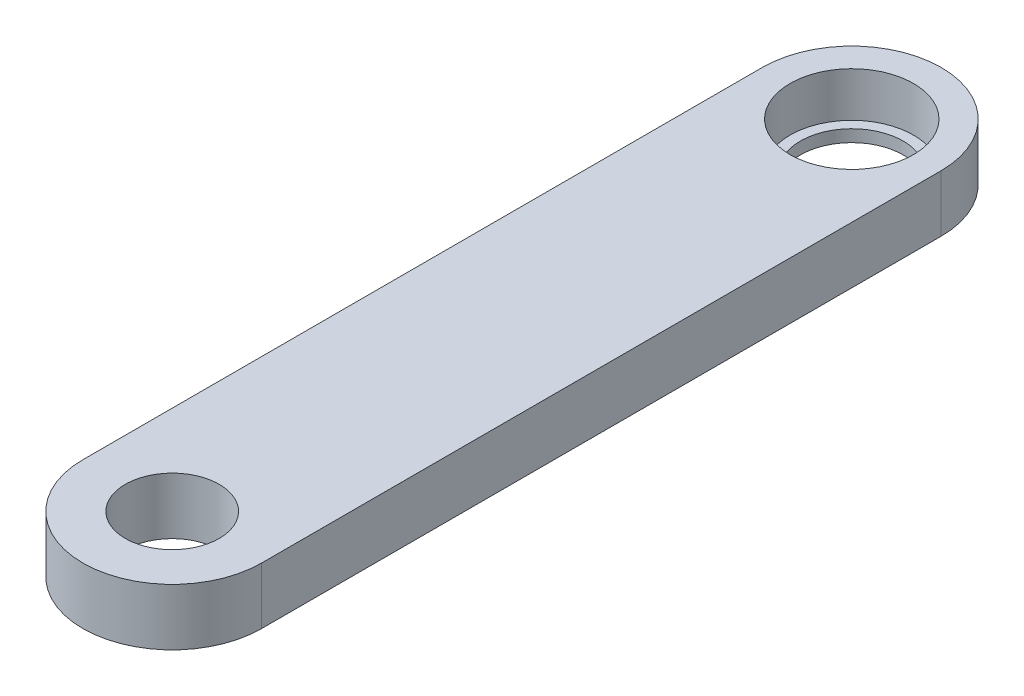
ISO-10303-21;
HEADER;
FILE_DESCRIPTION(('STEP AP214'),'2;1');
FILE_NAME('part.step','',(''),(''),'','','');
FILE_SCHEMA(('AUTOMOTIVE_DESIGN { 1 0 10303 214 1 1 1 1 }'));
ENDSEC;
DATA;
#1=APPLICATION_CONTEXT('core data for automotive mechanical design processes');
#2=APPLICATION_PROTOCOL_DEFINITION('international standard','automotive_design',2000,#1);
#3=PRODUCT_CONTEXT('',#1,'mechanical');
#4=PRODUCT('Part','Part','',(#3));
#5=PRODUCT_RELATED_PRODUCT_CATEGORY('part','',(#4));
#6=PRODUCT_DEFINITION_FORMATION('','',#4);
#7=PRODUCT_DEFINITION_CONTEXT('part definition',#1,'design');
#8=PRODUCT_DEFINITION('design','',#6,#7);
#9=PRODUCT_DEFINITION_SHAPE('','',#8);
#10=(LENGTH_UNIT() NAMED_UNIT(*) SI_UNIT(.MILLI.,.METRE.));
#11=(NAMED_UNIT(*) PLANE_ANGLE_UNIT() SI_UNIT($,.RADIAN.));
#12=(NAMED_UNIT(*) SI_UNIT($,.STERADIAN.) SOLID_ANGLE_UNIT());
#13=UNCERTAINTY_MEASURE_WITH_UNIT(LENGTH_MEASURE(1.E-05),#10,'distance_accuracy_value','');
#14=(GEOMETRIC_REPRESENTATION_CONTEXT(3) GLOBAL_UNCERTAINTY_ASSIGNED_CONTEXT((#13)) GLOBAL_UNIT_ASSIGNED_CONTEXT((#10,
#11,#12)) REPRESENTATION_CONTEXT('',''));
#15=CARTESIAN_POINT('',(0.,0.,0.));
#16=DIRECTION('',(0.,0.,1.));
#17=DIRECTION('',(1.,0.,0.));
#18=AXIS2_PLACEMENT_3D('',#15,#16,#17);
#19=CARTESIAN_POINT('',(0.,1.5875,-19.));
#20=DIRECTION('',(0.,-1.,0.));
#21=DIRECTION('',(0.,0.,-1.));
#22=AXIS2_PLACEMENT_3D('',#19,#20,#21);
#23=CYLINDRICAL_SURFACE('',#22,5.);
#24=CARTESIAN_POINT('',(0.,-1.5875,-19.));
#25=DIRECTION('',(0.,1.,0.));
#26=DIRECTION('',(0.,0.,1.));
#27=AXIS2_PLACEMENT_3D('',#24,#25,#26);
#28=CIRCLE('',#27,5.);
#29=CARTESIAN_POINT('',(-5.,-1.5875,-19.));
#30=VERTEX_POINT('',#29);
#31=CARTESIAN_POINT('',(5.,-1.5875,-19.));
#32=VERTEX_POINT('',#31);
#33=EDGE_CURVE('E117',#30,#32,#28,.F.);
#34=ORIENTED_EDGE('',*,*,#33,.F.);
#35=DIRECTION('',(0.,-1.,0.));
#36=VECTOR('',#35,1.);
#37=CARTESIAN_POINT('',(-5.,1.5875,-19.));
#38=LINE('',#37,#36);
#39=CARTESIAN_POINT('',(-5.,1.5875,-19.));
#40=VERTEX_POINT('',#39);
#41=EDGE_CURVE('E11',#40,#30,#38,.T.);
#42=ORIENTED_EDGE('',*,*,#41,.F.);
#43=CARTESIAN_POINT('',(0.,1.5875,-19.));
#44=DIRECTION('',(0.,1.,0.));
#45=DIRECTION('',(0.,0.,1.));
#46=AXIS2_PLACEMENT_3D('',#43,#44,#45);
#47=CIRCLE('',#46,5.);
#48=CARTESIAN_POINT('',(5.,1.5875,-19.));
#49=VERTEX_POINT('',#48);
#50=EDGE_CURVE('E107',#40,#49,#47,.F.);
#51=ORIENTED_EDGE('',*,*,#50,.T.);
#52=DIRECTION('',(0.,-1.,0.));
#53=VECTOR('',#52,1.);
#54=CARTESIAN_POINT('',(5.,1.5875,-19.));
#55=LINE('',#54,#53);
#56=EDGE_CURVE('E86',#49,#32,#55,.T.);
#57=ORIENTED_EDGE('',*,*,#56,.T.);
#58=EDGE_LOOP('',(#34,#42,#51,#57));
#59=FACE_BOUND('',#58,.T.);
#60=ADVANCED_FACE('F47',(#59),#23,.T.);
#61=CARTESIAN_POINT('',(-5.,1.5875,0.));
#62=DIRECTION('',(-1.,0.,0.));
#63=DIRECTION('',(0.,0.,1.));
#64=AXIS2_PLACEMENT_3D('',#61,#62,#63);
#65=PLANE('',#64);
#66=DIRECTION('',(0.,0.,-1.));
#67=VECTOR('',#66,1.);
#68=CARTESIAN_POINT('',(-5.,-1.5875,0.));
#69=LINE('',#68,#67);
#70=CARTESIAN_POINT('',(-5.,-1.5875,19.));
#71=VERTEX_POINT('',#70);
#72=EDGE_CURVE('E99',#71,#30,#69,.T.);
#73=ORIENTED_EDGE('',*,*,#72,.F.);
#74=DIRECTION('',(0.,-1.,0.));
#75=VECTOR('',#74,1.);
#76=CARTESIAN_POINT('',(-5.,1.5875,19.));
#77=LINE('',#76,#75);
#78=CARTESIAN_POINT('',(-5.,1.5875,19.));
#79=VERTEX_POINT('',#78);
#80=EDGE_CURVE('E56',#79,#71,#77,.T.);
#81=ORIENTED_EDGE('',*,*,#80,.F.);
#82=DIRECTION('',(0.,0.,-1.));
#83=VECTOR('',#82,1.);
#84=CARTESIAN_POINT('',(-5.,1.5875,0.));
#85=LINE('',#84,#83);
#86=EDGE_CURVE('E97',#79,#40,#85,.T.);
#87=ORIENTED_EDGE('',*,*,#86,.T.);
#88=ORIENTED_EDGE('',*,*,#41,.T.);
#89=EDGE_LOOP('',(#73,#81,#87,#88));
#90=FACE_BOUND('',#89,.T.);
#91=ADVANCED_FACE('F95',(#90),#65,.T.);
#92=CARTESIAN_POINT('',(0.,1.5875,19.));
#93=DIRECTION('',(0.,-1.,0.));
#94=DIRECTION('',(0.,0.,-1.));
#95=AXIS2_PLACEMENT_3D('',#92,#93,#94);
#96=CYLINDRICAL_SURFACE('',#95,5.);
#97=CARTESIAN_POINT('',(0.,-1.5875,19.));
#98=DIRECTION('',(0.,1.,0.));
#99=DIRECTION('',(0.,0.,1.));
#100=AXIS2_PLACEMENT_3D('',#97,#98,#99);
#101=CIRCLE('',#100,5.);
#102=CARTESIAN_POINT('',(5.00000000000001,-1.5875,19.));
#103=VERTEX_POINT('',#102);
#104=EDGE_CURVE('E79',#71,#103,#101,.T.);
#105=ORIENTED_EDGE('',*,*,#104,.T.);
#106=DIRECTION('',(0.,-1.,0.));
#107=VECTOR('',#106,1.);
#108=CARTESIAN_POINT('',(5.00000000000001,1.5875,19.));
#109=LINE('',#108,#107);
#110=CARTESIAN_POINT('',(5.00000000000001,1.5875,19.));
#111=VERTEX_POINT('',#110);
#112=EDGE_CURVE('E101',#111,#103,#109,.T.);
#113=ORIENTED_EDGE('',*,*,#112,.F.);
#114=CARTESIAN_POINT('',(0.,1.5875,19.));
#115=DIRECTION('',(0.,1.,0.));
#116=DIRECTION('',(0.,0.,1.));
#117=AXIS2_PLACEMENT_3D('',#114,#115,#116);
#118=CIRCLE('',#117,5.);
#119=EDGE_CURVE('E102',#79,#111,#118,.T.);
#120=ORIENTED_EDGE('',*,*,#119,.F.);
#121=ORIENTED_EDGE('',*,*,#80,.T.);
#122=EDGE_LOOP('',(#105,#113,#120,#121));
#123=FACE_BOUND('',#122,.T.);
#124=ADVANCED_FACE('F103',(#123),#96,.T.);
#125=CARTESIAN_POINT('',(5.,1.5875,0.));
#126=DIRECTION('',(-1.,0.,0.));
#127=DIRECTION('',(0.,0.,1.));
#128=AXIS2_PLACEMENT_3D('',#125,#126,#127);
#129=PLANE('',#128);
#130=DIRECTION('',(0.,0.,-1.));
#131=VECTOR('',#130,1.);
#132=CARTESIAN_POINT('',(5.,-1.5875,0.));
#133=LINE('',#132,#131);
#134=EDGE_CURVE('E111',#103,#32,#133,.T.);
#135=ORIENTED_EDGE('',*,*,#134,.T.);
#136=ORIENTED_EDGE('',*,*,#56,.F.);
#137=DIRECTION('',(0.,0.,-1.));
#138=VECTOR('',#137,1.);
#139=CARTESIAN_POINT('',(5.,1.5875,0.));
#140=LINE('',#139,#138);
#141=EDGE_CURVE('E64',#111,#49,#140,.T.);
#142=ORIENTED_EDGE('',*,*,#141,.F.);
#143=ORIENTED_EDGE('',*,*,#112,.T.);
#144=EDGE_LOOP('',(#135,#136,#142,#143));
#145=FACE_BOUND('',#144,.T.);
#146=ADVANCED_FACE('F133',(#145),#129,.F.);
#147=CARTESIAN_POINT('',(0.,1.5875,0.));
#148=DIRECTION('',(0.,1.,0.));
#149=DIRECTION('',(0.,0.,1.));
#150=AXIS2_PLACEMENT_3D('',#147,#148,#149);
#151=PLANE('',#150);
#152=CARTESIAN_POINT('',(0.,1.5875,19.));
#153=DIRECTION('',(0.,1.,0.));
#154=DIRECTION('',(0.,0.,1.));
#155=AXIS2_PLACEMENT_3D('',#152,#153,#154);
#156=CIRCLE('',#155,2.625);
#157=CARTESIAN_POINT('',(0.,1.5875,21.625));
#158=VERTEX_POINT('',#157);
#159=EDGE_CURVE('E176',#158,#158,#156,.T.);
#160=ORIENTED_EDGE('',*,*,#159,.F.);
#161=EDGE_LOOP('',(#160));
#162=FACE_BOUND('',#161,.T.);
#163=CARTESIAN_POINT('',(0.,1.5875,-19.));
#164=DIRECTION('',(0.,1.,0.));
#165=DIRECTION('',(0.,0.,1.));
#166=AXIS2_PLACEMENT_3D('',#163,#164,#165);
#167=CIRCLE('',#166,3.45);
#168=CARTESIAN_POINT('',(0.,1.5875,-15.55));
#169=VERTEX_POINT('',#168);
#170=EDGE_CURVE('E187',#169,#169,#167,.T.);
#171=ORIENTED_EDGE('',*,*,#170,.F.);
#172=EDGE_LOOP('',(#171));
#173=FACE_BOUND('',#172,.T.);
#174=ORIENTED_EDGE('',*,*,#50,.F.);
#175=ORIENTED_EDGE('',*,*,#86,.F.);
#176=ORIENTED_EDGE('',*,*,#119,.T.);
#177=ORIENTED_EDGE('',*,*,#141,.T.);
#178=EDGE_LOOP('',(#174,#175,#176,#177));
#179=FACE_BOUND('',#178,.T.);
#180=ADVANCED_FACE('F106',(#162,#173,#179),#151,.T.);
#181=CARTESIAN_POINT('',(0.,-1.5875,0.));
#182=DIRECTION('',(0.,1.,0.));
#183=DIRECTION('',(0.,0.,1.));
#184=AXIS2_PLACEMENT_3D('',#181,#182,#183);
#185=PLANE('',#184);
#186=CARTESIAN_POINT('',(0.,-1.5875,19.));
#187=DIRECTION('',(0.,1.,0.));
#188=DIRECTION('',(0.,0.,1.));
#189=AXIS2_PLACEMENT_3D('',#186,#187,#188);
#190=CIRCLE('',#189,2.625);
#191=CARTESIAN_POINT('',(0.,-1.5875,21.625));
#192=VERTEX_POINT('',#191);
#193=EDGE_CURVE('E173',#192,#192,#190,.T.);
#194=ORIENTED_EDGE('',*,*,#193,.T.);
#195=EDGE_LOOP('',(#194));
#196=FACE_BOUND('',#195,.T.);
#197=CARTESIAN_POINT('',(0.,-1.5875,-19.));
#198=DIRECTION('',(0.,1.,0.));
#199=DIRECTION('',(0.,0.,1.));
#200=AXIS2_PLACEMENT_3D('',#197,#198,#199);
#201=CIRCLE('',#200,2.875);
#202=CARTESIAN_POINT('',(0.,-1.5875,-16.125));
#203=VERTEX_POINT('',#202);
#204=EDGE_CURVE('E183',#203,#203,#201,.T.);
#205=ORIENTED_EDGE('',*,*,#204,.T.);
#206=EDGE_LOOP('',(#205));
#207=FACE_BOUND('',#206,.T.);
#208=ORIENTED_EDGE('',*,*,#33,.T.);
#209=ORIENTED_EDGE('',*,*,#134,.F.);
#210=ORIENTED_EDGE('',*,*,#104,.F.);
#211=ORIENTED_EDGE('',*,*,#72,.T.);
#212=EDGE_LOOP('',(#208,#209,#210,#211));
#213=FACE_BOUND('',#212,.T.);
#214=ADVANCED_FACE('F135',(#196,#207,#213),#185,.F.);
#215=CARTESIAN_POINT('',(0.,-0.9125,-19.));
#216=DIRECTION('',(0.,1.,0.));
#217=DIRECTION('',(0.,0.,1.));
#218=AXIS2_PLACEMENT_3D('',#215,#216,#217);
#219=CYLINDRICAL_SURFACE('',#218,3.45);
#220=CARTESIAN_POINT('',(0.,-0.9125,-19.));
#221=DIRECTION('',(0.,1.,0.));
#222=DIRECTION('',(0.,0.,1.));
#223=AXIS2_PLACEMENT_3D('',#220,#221,#222);
#224=CIRCLE('',#223,3.45);
#225=CARTESIAN_POINT('',(0.,-0.9125,-15.55));
#226=VERTEX_POINT('',#225);
#227=EDGE_CURVE('E121',#226,#226,#224,.T.);
#228=ORIENTED_EDGE('',*,*,#227,.F.);
#229=EDGE_LOOP('',(#228));
#230=FACE_BOUND('',#229,.T.);
#231=ORIENTED_EDGE('',*,*,#170,.T.);
#232=EDGE_LOOP('',(#231));
#233=FACE_BOUND('',#232,.T.);
#234=ADVANCED_FACE('F149',(#230,#233),#219,.F.);
#235=CARTESIAN_POINT('',(0.,-0.9125,-19.));
#236=DIRECTION('',(0.,1.,0.));
#237=DIRECTION('',(0.,0.,1.));
#238=AXIS2_PLACEMENT_3D('',#235,#236,#237);
#239=PLANE('',#238);
#240=CARTESIAN_POINT('',(0.,-0.9125,-19.));
#241=DIRECTION('',(0.,1.,0.));
#242=DIRECTION('',(0.,0.,1.));
#243=AXIS2_PLACEMENT_3D('',#240,#241,#242);
#244=CIRCLE('',#243,2.875);
#245=CARTESIAN_POINT('',(0.,-0.9125,-16.125));
#246=VERTEX_POINT('',#245);
#247=EDGE_CURVE('E180',#246,#246,#244,.T.);
#248=ORIENTED_EDGE('',*,*,#247,.F.);
#249=EDGE_LOOP('',(#248));
#250=FACE_BOUND('',#249,.T.);
#251=ORIENTED_EDGE('',*,*,#227,.T.);
#252=EDGE_LOOP('',(#251));
#253=FACE_BOUND('',#252,.T.);
#254=ADVANCED_FACE('F156',(#250,#253),#239,.T.);
#255=CARTESIAN_POINT('',(0.,-1.5875,-19.));
#256=DIRECTION('',(0.,1.,0.));
#257=DIRECTION('',(0.,0.,1.));
#258=AXIS2_PLACEMENT_3D('',#255,#256,#257);
#259=CYLINDRICAL_SURFACE('',#258,2.875);
#260=ORIENTED_EDGE('',*,*,#204,.F.);
#261=EDGE_LOOP('',(#260));
#262=FACE_BOUND('',#261,.T.);
#263=ORIENTED_EDGE('',*,*,#247,.T.);
#264=EDGE_LOOP('',(#263));
#265=FACE_BOUND('',#264,.T.);
#266=ADVANCED_FACE('F160',(#262,#265),#259,.F.);
#267=CARTESIAN_POINT('',(0.,-1.5875,19.));
#268=DIRECTION('',(0.,1.,0.));
#269=DIRECTION('',(0.,0.,1.));
#270=AXIS2_PLACEMENT_3D('',#267,#268,#269);
#271=CYLINDRICAL_SURFACE('',#270,2.625);
#272=ORIENTED_EDGE('',*,*,#193,.F.);
#273=EDGE_LOOP('',(#272));
#274=FACE_BOUND('',#273,.T.);
#275=ORIENTED_EDGE('',*,*,#159,.T.);
#276=EDGE_LOOP('',(#275));
#277=FACE_BOUND('',#276,.T.);
#278=ADVANCED_FACE('F164',(#274,#277),#271,.F.);
#279=CLOSED_SHELL('',(#60,#91,#124,#146,#180,#214,#234,#254,#266,#278));
#280=MANIFOLD_SOLID_BREP('B2',#279);
#281=ADVANCED_BREP_SHAPE_REPRESENTATION('',(#18,#280),#14);
#282=SHAPE_DEFINITION_REPRESENTATION(#9,#281);
ENDSEC;
END-ISO-10303-21;
